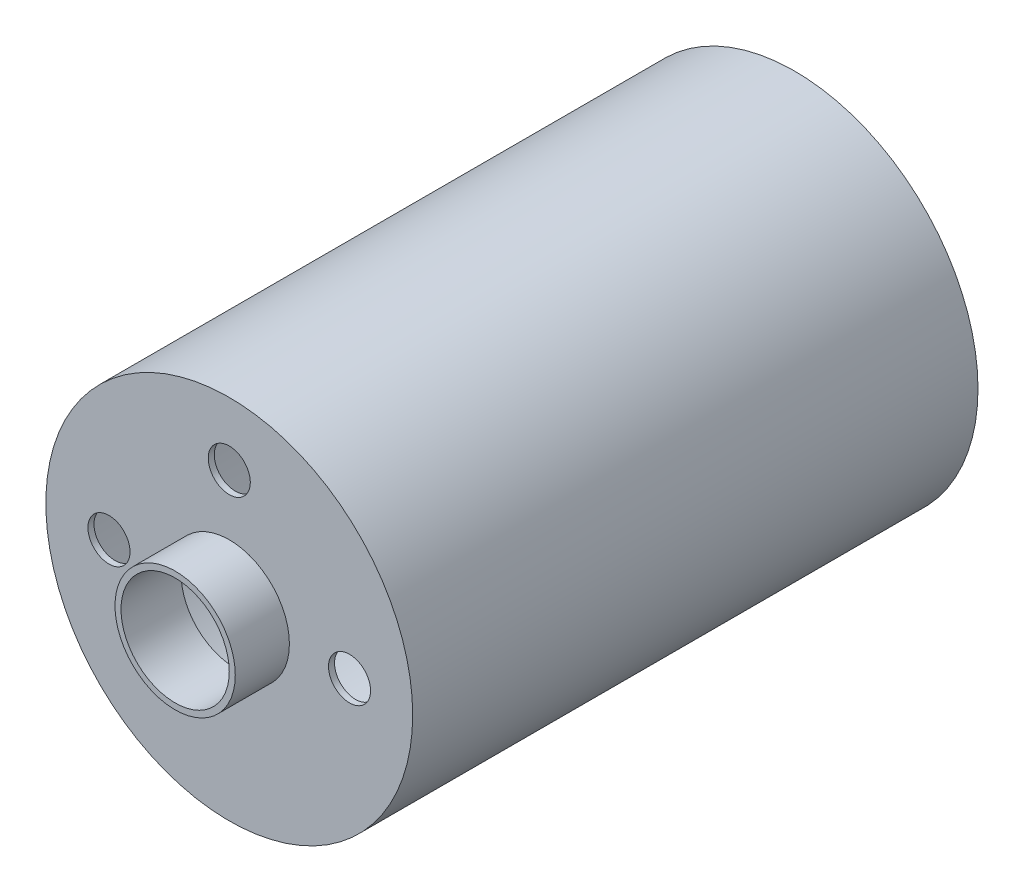
ISO-10303-21;
HEADER;
FILE_DESCRIPTION(('STEP AP214'),'2;1');
FILE_NAME('part.step','',(''),(''),'','','');
FILE_SCHEMA(('AUTOMOTIVE_DESIGN { 1 0 10303 214 1 1 1 1 }'));
ENDSEC;
DATA;
#1=APPLICATION_CONTEXT('core data for automotive mechanical design processes');
#2=APPLICATION_PROTOCOL_DEFINITION('international standard','automotive_design',2000,#1);
#3=PRODUCT_CONTEXT('',#1,'mechanical');
#4=PRODUCT('Part','Part','',(#3));
#5=PRODUCT_RELATED_PRODUCT_CATEGORY('part','',(#4));
#6=PRODUCT_DEFINITION_FORMATION('','',#4);
#7=PRODUCT_DEFINITION_CONTEXT('part definition',#1,'design');
#8=PRODUCT_DEFINITION('design','',#6,#7);
#9=PRODUCT_DEFINITION_SHAPE('','',#8);
#10=(LENGTH_UNIT() NAMED_UNIT(*) SI_UNIT(.MILLI.,.METRE.));
#11=(NAMED_UNIT(*) PLANE_ANGLE_UNIT() SI_UNIT($,.RADIAN.));
#12=(NAMED_UNIT(*) SI_UNIT($,.STERADIAN.) SOLID_ANGLE_UNIT());
#13=UNCERTAINTY_MEASURE_WITH_UNIT(LENGTH_MEASURE(1.E-05),#10,'distance_accuracy_value','');
#14=(GEOMETRIC_REPRESENTATION_CONTEXT(3) GLOBAL_UNCERTAINTY_ASSIGNED_CONTEXT((#13)) GLOBAL_UNIT_ASSIGNED_CONTEXT((#10,
#11,#12)) REPRESENTATION_CONTEXT('',''));
#15=CARTESIAN_POINT('',(0.,0.,0.));
#16=DIRECTION('',(0.,0.,1.));
#17=DIRECTION('',(1.,0.,0.));
#18=AXIS2_PLACEMENT_3D('',#15,#16,#17);
#19=CARTESIAN_POINT('',(0.,0.,23.5));
#20=DIRECTION('',(0.,0.,-1.));
#21=DIRECTION('',(-1.,0.,0.));
#22=AXIS2_PLACEMENT_3D('',#19,#20,#21);
#23=CYLINDRICAL_SURFACE('',#22,15.25);
#24=CARTESIAN_POINT('',(0.,0.,23.5));
#25=DIRECTION('',(0.,0.,1.));
#26=DIRECTION('',(1.,0.,0.));
#27=AXIS2_PLACEMENT_3D('',#24,#25,#26);
#28=CIRCLE('',#27,15.25);
#29=CARTESIAN_POINT('',(15.25,0.,23.5));
#30=VERTEX_POINT('',#29);
#31=EDGE_CURVE('E52',#30,#30,#28,.T.);
#32=ORIENTED_EDGE('',*,*,#31,.F.);
#33=EDGE_LOOP('',(#32));
#34=FACE_BOUND('',#33,.T.);
#35=CARTESIAN_POINT('',(0.,0.,-23.5));
#36=DIRECTION('',(0.,0.,1.));
#37=DIRECTION('',(1.,0.,0.));
#38=AXIS2_PLACEMENT_3D('',#35,#36,#37);
#39=CIRCLE('',#38,15.25);
#40=CARTESIAN_POINT('',(15.25,0.,-23.5));
#41=VERTEX_POINT('',#40);
#42=EDGE_CURVE('E57',#41,#41,#39,.T.);
#43=ORIENTED_EDGE('',*,*,#42,.T.);
#44=EDGE_LOOP('',(#43));
#45=FACE_BOUND('',#44,.T.);
#46=ADVANCED_FACE('F45',(#34,#45),#23,.T.);
#47=CARTESIAN_POINT('',(0.,0.,23.5));
#48=DIRECTION('',(0.,0.,1.));
#49=DIRECTION('',(1.,0.,0.));
#50=AXIS2_PLACEMENT_3D('',#47,#48,#49);
#51=PLANE('',#50);
#52=CARTESIAN_POINT('',(-10.,0.,23.5));
#53=DIRECTION('',(0.,0.,1.));
#54=DIRECTION('',(1.,0.,0.));
#55=AXIS2_PLACEMENT_3D('',#52,#53,#54);
#56=CIRCLE('',#55,1.75);
#57=CARTESIAN_POINT('',(-8.25,0.,23.5));
#58=VERTEX_POINT('',#57);
#59=EDGE_CURVE('E68',#58,#58,#56,.T.);
#60=ORIENTED_EDGE('',*,*,#59,.F.);
#61=EDGE_LOOP('',(#60));
#62=FACE_BOUND('',#61,.T.);
#63=CARTESIAN_POINT('',(0.,10.,23.5));
#64=DIRECTION('',(0.,0.,1.));
#65=DIRECTION('',(1.,0.,0.));
#66=AXIS2_PLACEMENT_3D('',#63,#64,#65);
#67=CIRCLE('',#66,1.75);
#68=CARTESIAN_POINT('',(1.75000000000003,10.,23.5));
#69=VERTEX_POINT('',#68);
#70=EDGE_CURVE('E92',#69,#69,#67,.T.);
#71=ORIENTED_EDGE('',*,*,#70,.F.);
#72=EDGE_LOOP('',(#71));
#73=FACE_BOUND('',#72,.T.);
#74=CARTESIAN_POINT('',(10.,0.,23.5));
#75=DIRECTION('',(0.,0.,1.));
#76=DIRECTION('',(1.,0.,0.));
#77=AXIS2_PLACEMENT_3D('',#74,#75,#76);
#78=CIRCLE('',#77,1.75);
#79=CARTESIAN_POINT('',(11.75,0.,23.5));
#80=VERTEX_POINT('',#79);
#81=EDGE_CURVE('E89',#80,#80,#78,.T.);
#82=ORIENTED_EDGE('',*,*,#81,.F.);
#83=EDGE_LOOP('',(#82));
#84=FACE_BOUND('',#83,.T.);
#85=CARTESIAN_POINT('',(0.,0.,23.5));
#86=DIRECTION('',(0.,0.,1.));
#87=DIRECTION('',(1.,0.,0.));
#88=AXIS2_PLACEMENT_3D('',#85,#86,#87);
#89=CIRCLE('',#88,5.);
#90=CARTESIAN_POINT('',(5.,0.,23.5));
#91=VERTEX_POINT('',#90);
#92=EDGE_CURVE('E10',#91,#91,#89,.T.);
#93=ORIENTED_EDGE('',*,*,#92,.F.);
#94=EDGE_LOOP('',(#93));
#95=FACE_BOUND('',#94,.T.);
#96=ORIENTED_EDGE('',*,*,#31,.T.);
#97=EDGE_LOOP('',(#96));
#98=FACE_BOUND('',#97,.T.);
#99=ADVANCED_FACE('F101',(#62,#73,#84,#95,#98),#51,.T.);
#100=CARTESIAN_POINT('',(0.,0.,-23.5));
#101=DIRECTION('',(0.,0.,1.));
#102=DIRECTION('',(1.,0.,0.));
#103=AXIS2_PLACEMENT_3D('',#100,#101,#102);
#104=PLANE('',#103);
#105=CARTESIAN_POINT('',(0.,0.,-23.5));
#106=DIRECTION('',(0.,0.,1.));
#107=DIRECTION('',(1.,0.,0.));
#108=AXIS2_PLACEMENT_3D('',#105,#106,#107);
#109=CIRCLE('',#108,14.75);
#110=CARTESIAN_POINT('',(14.75,0.,-23.5));
#111=VERTEX_POINT('',#110);
#112=EDGE_CURVE('E77',#111,#111,#109,.T.);
#113=ORIENTED_EDGE('',*,*,#112,.T.);
#114=EDGE_LOOP('',(#113));
#115=FACE_BOUND('',#114,.T.);
#116=ORIENTED_EDGE('',*,*,#42,.F.);
#117=EDGE_LOOP('',(#116));
#118=FACE_BOUND('',#117,.T.);
#119=ADVANCED_FACE('F104',(#115,#118),#104,.F.);
#120=CARTESIAN_POINT('',(0.,0.,28.));
#121=DIRECTION('',(0.,0.,-1.));
#122=DIRECTION('',(-1.,0.,0.));
#123=AXIS2_PLACEMENT_3D('',#120,#121,#122);
#124=CYLINDRICAL_SURFACE('',#123,5.);
#125=CARTESIAN_POINT('',(0.,0.,28.));
#126=DIRECTION('',(0.,0.,1.));
#127=DIRECTION('',(1.,0.,0.));
#128=AXIS2_PLACEMENT_3D('',#125,#126,#127);
#129=CIRCLE('',#128,5.);
#130=CARTESIAN_POINT('',(5.,0.,28.));
#131=VERTEX_POINT('',#130);
#132=EDGE_CURVE('E60',#131,#131,#129,.T.);
#133=ORIENTED_EDGE('',*,*,#132,.F.);
#134=EDGE_LOOP('',(#133));
#135=FACE_BOUND('',#134,.T.);
#136=ORIENTED_EDGE('',*,*,#92,.T.);
#137=EDGE_LOOP('',(#136));
#138=FACE_BOUND('',#137,.T.);
#139=ADVANCED_FACE('F118',(#135,#138),#124,.T.);
#140=CARTESIAN_POINT('',(0.,0.,28.));
#141=DIRECTION('',(0.,0.,1.));
#142=DIRECTION('',(1.,0.,0.));
#143=AXIS2_PLACEMENT_3D('',#140,#141,#142);
#144=PLANE('',#143);
#145=CARTESIAN_POINT('',(0.,0.,28.));
#146=DIRECTION('',(0.,0.,1.));
#147=DIRECTION('',(1.,0.,0.));
#148=AXIS2_PLACEMENT_3D('',#145,#146,#147);
#149=CIRCLE('',#148,4.5);
#150=CARTESIAN_POINT('',(4.5,0.,28.));
#151=VERTEX_POINT('',#150);
#152=EDGE_CURVE('E73',#151,#151,#149,.T.);
#153=ORIENTED_EDGE('',*,*,#152,.F.);
#154=EDGE_LOOP('',(#153));
#155=FACE_BOUND('',#154,.T.);
#156=ORIENTED_EDGE('',*,*,#132,.T.);
#157=EDGE_LOOP('',(#156));
#158=FACE_BOUND('',#157,.T.);
#159=ADVANCED_FACE('F124',(#155,#158),#144,.T.);
#160=CARTESIAN_POINT('',(0.,0.,23.5));
#161=DIRECTION('',(0.,0.,-1.));
#162=DIRECTION('',(-1.,0.,0.));
#163=AXIS2_PLACEMENT_3D('',#160,#161,#162);
#164=CYLINDRICAL_SURFACE('',#163,14.75);
#165=CARTESIAN_POINT('',(0.,0.,23.));
#166=DIRECTION('',(0.,0.,1.));
#167=DIRECTION('',(1.,0.,0.));
#168=AXIS2_PLACEMENT_3D('',#165,#166,#167);
#169=CIRCLE('',#168,14.75);
#170=CARTESIAN_POINT('',(14.75,0.,23.));
#171=VERTEX_POINT('',#170);
#172=EDGE_CURVE('E81',#171,#171,#169,.T.);
#173=ORIENTED_EDGE('',*,*,#172,.T.);
#174=EDGE_LOOP('',(#173));
#175=FACE_BOUND('',#174,.T.);
#176=ORIENTED_EDGE('',*,*,#112,.F.);
#177=EDGE_LOOP('',(#176));
#178=FACE_BOUND('',#177,.T.);
#179=ADVANCED_FACE('F129',(#175,#178),#164,.F.);
#180=CARTESIAN_POINT('',(0.,0.,23.));
#181=DIRECTION('',(0.,0.,1.));
#182=DIRECTION('',(1.,0.,0.));
#183=AXIS2_PLACEMENT_3D('',#180,#181,#182);
#184=PLANE('',#183);
#185=CARTESIAN_POINT('',(-10.,0.,23.));
#186=DIRECTION('',(0.,0.,1.));
#187=DIRECTION('',(1.,0.,0.));
#188=AXIS2_PLACEMENT_3D('',#185,#186,#187);
#189=CIRCLE('',#188,1.75);
#190=CARTESIAN_POINT('',(-8.25,0.,23.));
#191=VERTEX_POINT('',#190);
#192=EDGE_CURVE('E48',#191,#191,#189,.T.);
#193=ORIENTED_EDGE('',*,*,#192,.T.);
#194=EDGE_LOOP('',(#193));
#195=FACE_BOUND('',#194,.T.);
#196=CARTESIAN_POINT('',(0.,10.,23.));
#197=DIRECTION('',(0.,0.,1.));
#198=DIRECTION('',(1.,0.,0.));
#199=AXIS2_PLACEMENT_3D('',#196,#197,#198);
#200=CIRCLE('',#199,1.75);
#201=CARTESIAN_POINT('',(1.75000000000003,10.,23.));
#202=VERTEX_POINT('',#201);
#203=EDGE_CURVE('E67',#202,#202,#200,.T.);
#204=ORIENTED_EDGE('',*,*,#203,.T.);
#205=EDGE_LOOP('',(#204));
#206=FACE_BOUND('',#205,.T.);
#207=CARTESIAN_POINT('',(10.,0.,23.));
#208=DIRECTION('',(0.,0.,1.));
#209=DIRECTION('',(1.,0.,0.));
#210=AXIS2_PLACEMENT_3D('',#207,#208,#209);
#211=CIRCLE('',#210,1.75);
#212=CARTESIAN_POINT('',(11.75,0.,23.));
#213=VERTEX_POINT('',#212);
#214=EDGE_CURVE('E65',#213,#213,#211,.T.);
#215=ORIENTED_EDGE('',*,*,#214,.T.);
#216=EDGE_LOOP('',(#215));
#217=FACE_BOUND('',#216,.T.);
#218=CARTESIAN_POINT('',(0.,0.,23.));
#219=DIRECTION('',(0.,0.,1.));
#220=DIRECTION('',(1.,0.,0.));
#221=AXIS2_PLACEMENT_3D('',#218,#219,#220);
#222=CIRCLE('',#221,4.5);
#223=CARTESIAN_POINT('',(4.5,0.,23.));
#224=VERTEX_POINT('',#223);
#225=EDGE_CURVE('E84',#224,#224,#222,.T.);
#226=ORIENTED_EDGE('',*,*,#225,.T.);
#227=EDGE_LOOP('',(#226));
#228=FACE_BOUND('',#227,.T.);
#229=ORIENTED_EDGE('',*,*,#172,.F.);
#230=EDGE_LOOP('',(#229));
#231=FACE_BOUND('',#230,.T.);
#232=ADVANCED_FACE('F135',(#195,#206,#217,#228,#231),#184,.F.);
#233=CARTESIAN_POINT('',(0.,0.,28.));
#234=DIRECTION('',(0.,0.,-1.));
#235=DIRECTION('',(-1.,0.,0.));
#236=AXIS2_PLACEMENT_3D('',#233,#234,#235);
#237=CYLINDRICAL_SURFACE('',#236,4.5);
#238=ORIENTED_EDGE('',*,*,#152,.T.);
#239=EDGE_LOOP('',(#238));
#240=FACE_BOUND('',#239,.T.);
#241=ORIENTED_EDGE('',*,*,#225,.F.);
#242=EDGE_LOOP('',(#241));
#243=FACE_BOUND('',#242,.T.);
#244=ADVANCED_FACE('F131',(#240,#243),#237,.F.);
#245=CARTESIAN_POINT('',(10.,0.,19.));
#246=DIRECTION('',(0.,0.,1.));
#247=DIRECTION('',(1.,0.,0.));
#248=AXIS2_PLACEMENT_3D('',#245,#246,#247);
#249=CYLINDRICAL_SURFACE('',#248,1.75);
#250=ORIENTED_EDGE('',*,*,#81,.T.);
#251=EDGE_LOOP('',(#250));
#252=FACE_BOUND('',#251,.T.);
#253=ORIENTED_EDGE('',*,*,#214,.F.);
#254=EDGE_LOOP('',(#253));
#255=FACE_BOUND('',#254,.T.);
#256=ADVANCED_FACE('F134',(#252,#255),#249,.F.);
#257=CARTESIAN_POINT('',(0.,10.,19.));
#258=DIRECTION('',(0.,0.,1.));
#259=DIRECTION('',(1.,0.,0.));
#260=AXIS2_PLACEMENT_3D('',#257,#258,#259);
#261=CYLINDRICAL_SURFACE('',#260,1.75);
#262=ORIENTED_EDGE('',*,*,#70,.T.);
#263=EDGE_LOOP('',(#262));
#264=FACE_BOUND('',#263,.T.);
#265=ORIENTED_EDGE('',*,*,#203,.F.);
#266=EDGE_LOOP('',(#265));
#267=FACE_BOUND('',#266,.T.);
#268=ADVANCED_FACE('F143',(#264,#267),#261,.F.);
#269=CARTESIAN_POINT('',(-10.,0.,19.));
#270=DIRECTION('',(0.,0.,1.));
#271=DIRECTION('',(1.,0.,0.));
#272=AXIS2_PLACEMENT_3D('',#269,#270,#271);
#273=CYLINDRICAL_SURFACE('',#272,1.75);
#274=ORIENTED_EDGE('',*,*,#59,.T.);
#275=EDGE_LOOP('',(#274));
#276=FACE_BOUND('',#275,.T.);
#277=ORIENTED_EDGE('',*,*,#192,.F.);
#278=EDGE_LOOP('',(#277));
#279=FACE_BOUND('',#278,.T.);
#280=ADVANCED_FACE('F98',(#276,#279),#273,.F.);
#281=CLOSED_SHELL('',(#46,#99,#119,#139,#159,#179,#232,#244,#256,#268,#280));
#282=MANIFOLD_SOLID_BREP('B2',#281);
#283=ADVANCED_BREP_SHAPE_REPRESENTATION('',(#18,#282),#14);
#284=SHAPE_DEFINITION_REPRESENTATION(#9,#283);
ENDSEC;
END-ISO-10303-21;
